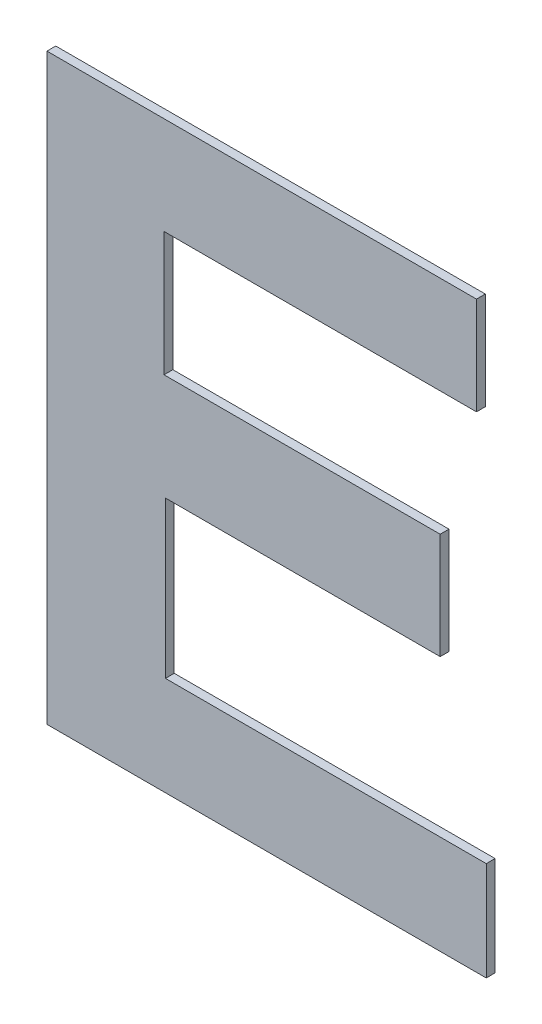
ISO-10303-21;
HEADER;
FILE_DESCRIPTION(('STEP AP214'),'2;1');
FILE_NAME('part.step','',(''),(''),'','','');
FILE_SCHEMA(('AUTOMOTIVE_DESIGN { 1 0 10303 214 1 1 1 1 }'));
ENDSEC;
DATA;
#1=APPLICATION_CONTEXT('core data for automotive mechanical design processes');
#2=APPLICATION_PROTOCOL_DEFINITION('international standard','automotive_design',2000,#1);
#3=PRODUCT_CONTEXT('',#1,'mechanical');
#4=PRODUCT('Part','Part','',(#3));
#5=PRODUCT_RELATED_PRODUCT_CATEGORY('part','',(#4));
#6=PRODUCT_DEFINITION_FORMATION('','',#4);
#7=PRODUCT_DEFINITION_CONTEXT('part definition',#1,'design');
#8=PRODUCT_DEFINITION('design','',#6,#7);
#9=PRODUCT_DEFINITION_SHAPE('','',#8);
#10=(LENGTH_UNIT() NAMED_UNIT(*) SI_UNIT(.MILLI.,.METRE.));
#11=(NAMED_UNIT(*) PLANE_ANGLE_UNIT() SI_UNIT($,.RADIAN.));
#12=(NAMED_UNIT(*) SI_UNIT($,.STERADIAN.) SOLID_ANGLE_UNIT());
#13=UNCERTAINTY_MEASURE_WITH_UNIT(LENGTH_MEASURE(1.E-05),#10,'distance_accuracy_value','');
#14=(GEOMETRIC_REPRESENTATION_CONTEXT(3) GLOBAL_UNCERTAINTY_ASSIGNED_CONTEXT((#13)) GLOBAL_UNIT_ASSIGNED_CONTEXT((#10,
#11,#12)) REPRESENTATION_CONTEXT('',''));
#15=CARTESIAN_POINT('',(0.,0.,0.));
#16=DIRECTION('',(0.,0.,1.));
#17=DIRECTION('',(1.,0.,0.));
#18=AXIS2_PLACEMENT_3D('',#15,#16,#17);
#19=CARTESIAN_POINT('',(3.1948232444765,-0.887060100571832,0.));
#20=DIRECTION('',(0.,1.,0.));
#21=DIRECTION('',(-1.,0.,0.));
#22=AXIS2_PLACEMENT_3D('',#19,#20,#21);
#23=PLANE('',#22);
#24=DIRECTION('',(-1.,0.,0.));
#25=VECTOR('',#24,1.);
#26=CARTESIAN_POINT('',(3.1948232444765,-0.887060100571832,0.));
#27=LINE('',#26,#25);
#28=CARTESIAN_POINT('',(3.1948232444765,-0.887060100571832,0.));
#29=VERTEX_POINT('',#28);
#30=CARTESIAN_POINT('',(3.085668951248,-0.887060100571832,0.));
#31=VERTEX_POINT('',#30);
#32=EDGE_CURVE('E11',#29,#31,#27,.T.);
#33=ORIENTED_EDGE('',*,*,#32,.T.);
#34=DIRECTION('',(0.,0.,1.));
#35=VECTOR('',#34,1.);
#36=CARTESIAN_POINT('',(3.085668951248,-0.887060100571832,0.));
#37=LINE('',#36,#35);
#38=CARTESIAN_POINT('',(3.085668951248,-0.887060100571832,0.003));
#39=VERTEX_POINT('',#38);
#40=EDGE_CURVE('E24',#31,#39,#37,.T.);
#41=ORIENTED_EDGE('',*,*,#40,.T.);
#42=DIRECTION('',(-1.,0.,0.));
#43=VECTOR('',#42,1.);
#44=CARTESIAN_POINT('',(3.1948232444765,-0.887060100571832,0.003));
#45=LINE('',#44,#43);
#46=CARTESIAN_POINT('',(3.1948232444765,-0.887060100571832,0.003));
#47=VERTEX_POINT('',#46);
#48=EDGE_CURVE('E124',#47,#39,#45,.T.);
#49=ORIENTED_EDGE('',*,*,#48,.F.);
#50=DIRECTION('',(0.,0.,1.));
#51=VECTOR('',#50,1.);
#52=CARTESIAN_POINT('',(3.1948232444765,-0.887060100571832,0.));
#53=LINE('',#52,#51);
#54=EDGE_CURVE('E206',#29,#47,#53,.T.);
#55=ORIENTED_EDGE('',*,*,#54,.F.);
#56=EDGE_LOOP('',(#33,#41,#49,#55));
#57=FACE_BOUND('',#56,.T.);
#58=ADVANCED_FACE('F17',(#57),#23,.T.);
#59=CARTESIAN_POINT('',(3.1948232444765,-0.920762187220293,0.));
#60=DIRECTION('',(1.,0.,0.));
#61=DIRECTION('',(0.,1.,0.));
#62=AXIS2_PLACEMENT_3D('',#59,#60,#61);
#63=PLANE('',#62);
#64=DIRECTION('',(0.,1.,0.));
#65=VECTOR('',#64,1.);
#66=CARTESIAN_POINT('',(3.1948232444765,-0.920762187220293,0.));
#67=LINE('',#66,#65);
#68=CARTESIAN_POINT('',(3.1948232444765,-0.920762187220293,0.));
#69=VERTEX_POINT('',#68);
#70=EDGE_CURVE('E203',#69,#29,#67,.T.);
#71=ORIENTED_EDGE('',*,*,#70,.T.);
#72=ORIENTED_EDGE('',*,*,#54,.T.);
#73=DIRECTION('',(0.,1.,0.));
#74=VECTOR('',#73,1.);
#75=CARTESIAN_POINT('',(3.1948232444765,-0.920762187220293,0.003));
#76=LINE('',#75,#74);
#77=CARTESIAN_POINT('',(3.1948232444765,-0.920762187220293,0.003));
#78=VERTEX_POINT('',#77);
#79=EDGE_CURVE('E201',#78,#47,#76,.T.);
#80=ORIENTED_EDGE('',*,*,#79,.F.);
#81=DIRECTION('',(0.,0.,1.));
#82=VECTOR('',#81,1.);
#83=CARTESIAN_POINT('',(3.1948232444765,-0.920762187220293,0.));
#84=LINE('',#83,#82);
#85=EDGE_CURVE('E198',#69,#78,#84,.T.);
#86=ORIENTED_EDGE('',*,*,#85,.F.);
#87=EDGE_LOOP('',(#71,#72,#80,#86));
#88=FACE_BOUND('',#87,.T.);
#89=ADVANCED_FACE('F235',(#88),#63,.T.);
#90=CARTESIAN_POINT('',(3.0453539502456,-0.920762187220293,0.));
#91=DIRECTION('',(0.,-1.,0.));
#92=DIRECTION('',(1.,0.,0.));
#93=AXIS2_PLACEMENT_3D('',#90,#91,#92);
#94=PLANE('',#93);
#95=DIRECTION('',(1.,0.,0.));
#96=VECTOR('',#95,1.);
#97=CARTESIAN_POINT('',(3.0453539502456,-0.920762187220293,0.));
#98=LINE('',#97,#96);
#99=CARTESIAN_POINT('',(3.0453539502456,-0.920762187220293,0.));
#100=VERTEX_POINT('',#99);
#101=EDGE_CURVE('E195',#100,#69,#98,.T.);
#102=ORIENTED_EDGE('',*,*,#101,.T.);
#103=ORIENTED_EDGE('',*,*,#85,.T.);
#104=DIRECTION('',(1.,0.,0.));
#105=VECTOR('',#104,1.);
#106=CARTESIAN_POINT('',(3.0453539502456,-0.920762187220293,0.003));
#107=LINE('',#106,#105);
#108=CARTESIAN_POINT('',(3.0453539502456,-0.920762187220293,0.003));
#109=VERTEX_POINT('',#108);
#110=EDGE_CURVE('E192',#109,#78,#107,.T.);
#111=ORIENTED_EDGE('',*,*,#110,.F.);
#112=DIRECTION('',(0.,0.,1.));
#113=VECTOR('',#112,1.);
#114=CARTESIAN_POINT('',(3.0453539502456,-0.920762187220293,0.));
#115=LINE('',#114,#113);
#116=EDGE_CURVE('E189',#100,#109,#115,.T.);
#117=ORIENTED_EDGE('',*,*,#116,.F.);
#118=EDGE_LOOP('',(#102,#103,#111,#117));
#119=FACE_BOUND('',#118,.T.);
#120=ADVANCED_FACE('F232',(#119),#94,.T.);
#121=CARTESIAN_POINT('',(3.0453539502456,-0.722389912967327,0.));
#122=DIRECTION('',(-1.,0.,0.));
#123=DIRECTION('',(0.,-1.,0.));
#124=AXIS2_PLACEMENT_3D('',#121,#122,#123);
#125=PLANE('',#124);
#126=DIRECTION('',(0.,-1.,0.));
#127=VECTOR('',#126,1.);
#128=CARTESIAN_POINT('',(3.0453539502456,-0.722389912967327,0.));
#129=LINE('',#128,#127);
#130=CARTESIAN_POINT('',(3.0453539502456,-0.722389912967327,0.));
#131=VERTEX_POINT('',#130);
#132=EDGE_CURVE('E186',#131,#100,#129,.T.);
#133=ORIENTED_EDGE('',*,*,#132,.T.);
#134=ORIENTED_EDGE('',*,*,#116,.T.);
#135=DIRECTION('',(0.,-1.,0.));
#136=VECTOR('',#135,1.);
#137=CARTESIAN_POINT('',(3.0453539502456,-0.722389912967327,0.003));
#138=LINE('',#137,#136);
#139=CARTESIAN_POINT('',(3.0453539502456,-0.722389912967327,0.003));
#140=VERTEX_POINT('',#139);
#141=EDGE_CURVE('E183',#140,#109,#138,.T.);
#142=ORIENTED_EDGE('',*,*,#141,.F.);
#143=DIRECTION('',(0.,0.,1.));
#144=VECTOR('',#143,1.);
#145=CARTESIAN_POINT('',(3.0453539502456,-0.722389912967327,0.));
#146=LINE('',#145,#144);
#147=EDGE_CURVE('E180',#131,#140,#146,.T.);
#148=ORIENTED_EDGE('',*,*,#147,.F.);
#149=EDGE_LOOP('',(#133,#134,#142,#148));
#150=FACE_BOUND('',#149,.T.);
#151=ADVANCED_FACE('F229',(#150),#125,.T.);
#152=CARTESIAN_POINT('',(3.1915002100181,-0.722389912967327,0.));
#153=DIRECTION('',(0.,1.,0.));
#154=DIRECTION('',(-1.,0.,0.));
#155=AXIS2_PLACEMENT_3D('',#152,#153,#154);
#156=PLANE('',#155);
#157=DIRECTION('',(-1.,0.,0.));
#158=VECTOR('',#157,1.);
#159=CARTESIAN_POINT('',(3.1915002100181,-0.722389912967327,0.));
#160=LINE('',#159,#158);
#161=CARTESIAN_POINT('',(3.1915002100181,-0.722389912967327,0.));
#162=VERTEX_POINT('',#161);
#163=EDGE_CURVE('E177',#162,#131,#160,.T.);
#164=ORIENTED_EDGE('',*,*,#163,.T.);
#165=ORIENTED_EDGE('',*,*,#147,.T.);
#166=DIRECTION('',(-1.,0.,0.));
#167=VECTOR('',#166,1.);
#168=CARTESIAN_POINT('',(3.1915002100181,-0.722389912967327,0.003));
#169=LINE('',#168,#167);
#170=CARTESIAN_POINT('',(3.1915002100181,-0.722389912967327,0.003));
#171=VERTEX_POINT('',#170);
#172=EDGE_CURVE('E174',#171,#140,#169,.T.);
#173=ORIENTED_EDGE('',*,*,#172,.F.);
#174=DIRECTION('',(0.,0.,1.));
#175=VECTOR('',#174,1.);
#176=CARTESIAN_POINT('',(3.1915002100181,-0.722389912967327,0.));
#177=LINE('',#176,#175);
#178=EDGE_CURVE('E171',#162,#171,#177,.T.);
#179=ORIENTED_EDGE('',*,*,#178,.F.);
#180=EDGE_LOOP('',(#164,#165,#173,#179));
#181=FACE_BOUND('',#180,.T.);
#182=ADVANCED_FACE('F226',(#181),#156,.T.);
#183=CARTESIAN_POINT('',(3.1915002100181,-0.755614573912357,0.));
#184=DIRECTION('',(1.,0.,0.));
#185=DIRECTION('',(0.,1.,0.));
#186=AXIS2_PLACEMENT_3D('',#183,#184,#185);
#187=PLANE('',#186);
#188=DIRECTION('',(0.,1.,0.));
#189=VECTOR('',#188,1.);
#190=CARTESIAN_POINT('',(3.1915002100181,-0.755614573912357,0.));
#191=LINE('',#190,#189);
#192=CARTESIAN_POINT('',(3.1915002100181,-0.755614573912357,0.));
#193=VERTEX_POINT('',#192);
#194=EDGE_CURVE('E168',#193,#162,#191,.T.);
#195=ORIENTED_EDGE('',*,*,#194,.T.);
#196=ORIENTED_EDGE('',*,*,#178,.T.);
#197=DIRECTION('',(0.,1.,0.));
#198=VECTOR('',#197,1.);
#199=CARTESIAN_POINT('',(3.1915002100181,-0.755614573912357,0.003));
#200=LINE('',#199,#198);
#201=CARTESIAN_POINT('',(3.1915002100181,-0.755614573912357,0.003));
#202=VERTEX_POINT('',#201);
#203=EDGE_CURVE('E165',#202,#171,#200,.T.);
#204=ORIENTED_EDGE('',*,*,#203,.F.);
#205=DIRECTION('',(0.,0.,1.));
#206=VECTOR('',#205,1.);
#207=CARTESIAN_POINT('',(3.1915002100181,-0.755614573912357,0.));
#208=LINE('',#207,#206);
#209=EDGE_CURVE('E162',#193,#202,#208,.T.);
#210=ORIENTED_EDGE('',*,*,#209,.F.);
#211=EDGE_LOOP('',(#195,#196,#204,#210));
#212=FACE_BOUND('',#211,.T.);
#213=ADVANCED_FACE('F223',(#212),#187,.T.);
#214=CARTESIAN_POINT('',(3.0851877364518,-0.755614573912357,0.));
#215=DIRECTION('',(0.,-1.,0.));
#216=DIRECTION('',(1.,0.,0.));
#217=AXIS2_PLACEMENT_3D('',#214,#215,#216);
#218=PLANE('',#217);
#219=DIRECTION('',(1.,0.,0.));
#220=VECTOR('',#219,1.);
#221=CARTESIAN_POINT('',(3.0851877364518,-0.755614573912357,0.));
#222=LINE('',#221,#220);
#223=CARTESIAN_POINT('',(3.0851877364518,-0.755614573912357,0.));
#224=VERTEX_POINT('',#223);
#225=EDGE_CURVE('E159',#224,#193,#222,.T.);
#226=ORIENTED_EDGE('',*,*,#225,.T.);
#227=ORIENTED_EDGE('',*,*,#209,.T.);
#228=DIRECTION('',(1.,0.,0.));
#229=VECTOR('',#228,1.);
#230=CARTESIAN_POINT('',(3.0851877364518,-0.755614573912357,0.003));
#231=LINE('',#230,#229);
#232=CARTESIAN_POINT('',(3.0851877364518,-0.755614573912357,0.003));
#233=VERTEX_POINT('',#232);
#234=EDGE_CURVE('E156',#233,#202,#231,.T.);
#235=ORIENTED_EDGE('',*,*,#234,.F.);
#236=DIRECTION('',(0.,0.,1.));
#237=VECTOR('',#236,1.);
#238=CARTESIAN_POINT('',(3.0851877364518,-0.755614573912357,0.));
#239=LINE('',#238,#237);
#240=EDGE_CURVE('E153',#224,#233,#239,.T.);
#241=ORIENTED_EDGE('',*,*,#240,.F.);
#242=EDGE_LOOP('',(#226,#227,#235,#241));
#243=FACE_BOUND('',#242,.T.);
#244=ADVANCED_FACE('F220',(#243),#218,.T.);
#245=CARTESIAN_POINT('',(3.0851877364518,-0.797845908640481,0.));
#246=DIRECTION('',(1.,0.,0.));
#247=DIRECTION('',(0.,1.,0.));
#248=AXIS2_PLACEMENT_3D('',#245,#246,#247);
#249=PLANE('',#248);
#250=DIRECTION('',(0.,1.,0.));
#251=VECTOR('',#250,1.);
#252=CARTESIAN_POINT('',(3.0851877364518,-0.797845908640481,0.));
#253=LINE('',#252,#251);
#254=CARTESIAN_POINT('',(3.0851877364518,-0.797845908640481,0.));
#255=VERTEX_POINT('',#254);
#256=EDGE_CURVE('E150',#255,#224,#253,.T.);
#257=ORIENTED_EDGE('',*,*,#256,.T.);
#258=ORIENTED_EDGE('',*,*,#240,.T.);
#259=DIRECTION('',(0.,1.,0.));
#260=VECTOR('',#259,1.);
#261=CARTESIAN_POINT('',(3.0851877364518,-0.797845908640481,0.003));
#262=LINE('',#261,#260);
#263=CARTESIAN_POINT('',(3.0851877364518,-0.797845908640481,0.003));
#264=VERTEX_POINT('',#263);
#265=EDGE_CURVE('E147',#264,#233,#262,.T.);
#266=ORIENTED_EDGE('',*,*,#265,.F.);
#267=DIRECTION('',(0.,0.,1.));
#268=VECTOR('',#267,1.);
#269=CARTESIAN_POINT('',(3.0851877364518,-0.797845908640481,0.));
#270=LINE('',#269,#268);
#271=EDGE_CURVE('E144',#255,#264,#270,.T.);
#272=ORIENTED_EDGE('',*,*,#271,.F.);
#273=EDGE_LOOP('',(#257,#258,#266,#272));
#274=FACE_BOUND('',#273,.T.);
#275=ADVANCED_FACE('F217',(#274),#249,.T.);
#276=CARTESIAN_POINT('',(3.1791449253996,-0.797845908640481,0.));
#277=DIRECTION('',(0.,1.,0.));
#278=DIRECTION('',(-1.,0.,0.));
#279=AXIS2_PLACEMENT_3D('',#276,#277,#278);
#280=PLANE('',#279);
#281=DIRECTION('',(-1.,0.,0.));
#282=VECTOR('',#281,1.);
#283=CARTESIAN_POINT('',(3.1791449253996,-0.797845908640481,0.));
#284=LINE('',#283,#282);
#285=CARTESIAN_POINT('',(3.1791449253996,-0.797845908640481,0.));
#286=VERTEX_POINT('',#285);
#287=EDGE_CURVE('E141',#286,#255,#284,.T.);
#288=ORIENTED_EDGE('',*,*,#287,.T.);
#289=ORIENTED_EDGE('',*,*,#271,.T.);
#290=DIRECTION('',(-1.,0.,0.));
#291=VECTOR('',#290,1.);
#292=CARTESIAN_POINT('',(3.1791449253996,-0.797845908640481,0.003));
#293=LINE('',#292,#291);
#294=CARTESIAN_POINT('',(3.1791449253996,-0.797845908640481,0.003));
#295=VERTEX_POINT('',#294);
#296=EDGE_CURVE('E138',#295,#264,#293,.T.);
#297=ORIENTED_EDGE('',*,*,#296,.F.);
#298=DIRECTION('',(0.,0.,1.));
#299=VECTOR('',#298,1.);
#300=CARTESIAN_POINT('',(3.1791449253996,-0.797845908640481,0.));
#301=LINE('',#300,#299);
#302=EDGE_CURVE('E135',#286,#295,#301,.T.);
#303=ORIENTED_EDGE('',*,*,#302,.F.);
#304=EDGE_LOOP('',(#288,#289,#297,#303));
#305=FACE_BOUND('',#304,.T.);
#306=ADVANCED_FACE('F214',(#305),#280,.T.);
#307=CARTESIAN_POINT('',(3.1791449253996,-0.833913336521115,0.));
#308=DIRECTION('',(1.,0.,0.));
#309=DIRECTION('',(0.,1.,0.));
#310=AXIS2_PLACEMENT_3D('',#307,#308,#309);
#311=PLANE('',#310);
#312=DIRECTION('',(0.,1.,0.));
#313=VECTOR('',#312,1.);
#314=CARTESIAN_POINT('',(3.1791449253996,-0.833913336521115,0.));
#315=LINE('',#314,#313);
#316=CARTESIAN_POINT('',(3.1791449253996,-0.833913336521115,0.));
#317=VERTEX_POINT('',#316);
#318=EDGE_CURVE('E132',#317,#286,#315,.T.);
#319=ORIENTED_EDGE('',*,*,#318,.T.);
#320=ORIENTED_EDGE('',*,*,#302,.T.);
#321=DIRECTION('',(0.,1.,0.));
#322=VECTOR('',#321,1.);
#323=CARTESIAN_POINT('',(3.1791449253996,-0.833913336521115,0.003));
#324=LINE('',#323,#322);
#325=CARTESIAN_POINT('',(3.1791449253996,-0.833913336521115,0.003));
#326=VERTEX_POINT('',#325);
#327=EDGE_CURVE('E130',#326,#295,#324,.T.);
#328=ORIENTED_EDGE('',*,*,#327,.F.);
#329=DIRECTION('',(0.,0.,1.));
#330=VECTOR('',#329,1.);
#331=CARTESIAN_POINT('',(3.1791449253996,-0.833913336521115,0.));
#332=LINE('',#331,#330);
#333=EDGE_CURVE('E109',#317,#326,#332,.T.);
#334=ORIENTED_EDGE('',*,*,#333,.F.);
#335=EDGE_LOOP('',(#319,#320,#328,#334));
#336=FACE_BOUND('',#335,.T.);
#337=ADVANCED_FACE('F212',(#336),#311,.T.);
#338=CARTESIAN_POINT('',(3.085668951248,-0.833913336521115,0.));
#339=DIRECTION('',(0.,-1.,0.));
#340=DIRECTION('',(1.,0.,0.));
#341=AXIS2_PLACEMENT_3D('',#338,#339,#340);
#342=PLANE('',#341);
#343=DIRECTION('',(1.,0.,0.));
#344=VECTOR('',#343,1.);
#345=CARTESIAN_POINT('',(3.085668951248,-0.833913336521115,0.));
#346=LINE('',#345,#344);
#347=CARTESIAN_POINT('',(3.085668951248,-0.833913336521115,0.));
#348=VERTEX_POINT('',#347);
#349=EDGE_CURVE('E113',#348,#317,#346,.T.);
#350=ORIENTED_EDGE('',*,*,#349,.T.);
#351=ORIENTED_EDGE('',*,*,#333,.T.);
#352=DIRECTION('',(1.,0.,0.));
#353=VECTOR('',#352,1.);
#354=CARTESIAN_POINT('',(3.085668951248,-0.833913336521115,0.003));
#355=LINE('',#354,#353);
#356=CARTESIAN_POINT('',(3.085668951248,-0.833913336521115,0.003));
#357=VERTEX_POINT('',#356);
#358=EDGE_CURVE('E102',#357,#326,#355,.T.);
#359=ORIENTED_EDGE('',*,*,#358,.F.);
#360=DIRECTION('',(0.,0.,1.));
#361=VECTOR('',#360,1.);
#362=CARTESIAN_POINT('',(3.085668951248,-0.833913336521115,0.));
#363=LINE('',#362,#361);
#364=EDGE_CURVE('E106',#348,#357,#363,.T.);
#365=ORIENTED_EDGE('',*,*,#364,.F.);
#366=EDGE_LOOP('',(#350,#351,#359,#365));
#367=FACE_BOUND('',#366,.T.);
#368=ADVANCED_FACE('F105',(#367),#342,.T.);
#369=CARTESIAN_POINT('',(3.085668951248,-0.887060100571832,0.));
#370=DIRECTION('',(1.,0.,0.));
#371=DIRECTION('',(0.,1.,0.));
#372=AXIS2_PLACEMENT_3D('',#369,#370,#371);
#373=PLANE('',#372);
#374=DIRECTION('',(0.,1.,0.));
#375=VECTOR('',#374,1.);
#376=CARTESIAN_POINT('',(3.085668951248,-0.887060100571832,0.));
#377=LINE('',#376,#375);
#378=EDGE_CURVE('E119',#31,#348,#377,.T.);
#379=ORIENTED_EDGE('',*,*,#378,.T.);
#380=ORIENTED_EDGE('',*,*,#364,.T.);
#381=DIRECTION('',(0.,1.,0.));
#382=VECTOR('',#381,1.);
#383=CARTESIAN_POINT('',(3.085668951248,-0.887060100571832,0.003));
#384=LINE('',#383,#382);
#385=EDGE_CURVE('E118',#39,#357,#384,.T.);
#386=ORIENTED_EDGE('',*,*,#385,.F.);
#387=ORIENTED_EDGE('',*,*,#40,.F.);
#388=EDGE_LOOP('',(#379,#380,#386,#387));
#389=FACE_BOUND('',#388,.T.);
#390=ADVANCED_FACE('F117',(#389),#373,.T.);
#391=CARTESIAN_POINT('',(3.120088597361,-0.82157605009381,0.003));
#392=DIRECTION('',(0.,0.,1.));
#393=DIRECTION('',(1.,0.,0.));
#394=AXIS2_PLACEMENT_3D('',#391,#392,#393);
#395=PLANE('',#394);
#396=ORIENTED_EDGE('',*,*,#385,.T.);
#397=ORIENTED_EDGE('',*,*,#358,.T.);
#398=ORIENTED_EDGE('',*,*,#327,.T.);
#399=ORIENTED_EDGE('',*,*,#296,.T.);
#400=ORIENTED_EDGE('',*,*,#265,.T.);
#401=ORIENTED_EDGE('',*,*,#234,.T.);
#402=ORIENTED_EDGE('',*,*,#203,.T.);
#403=ORIENTED_EDGE('',*,*,#172,.T.);
#404=ORIENTED_EDGE('',*,*,#141,.T.);
#405=ORIENTED_EDGE('',*,*,#110,.T.);
#406=ORIENTED_EDGE('',*,*,#79,.T.);
#407=ORIENTED_EDGE('',*,*,#48,.T.);
#408=EDGE_LOOP('',(#396,#397,#398,#399,#400,#401,#402,#403,#404,#405,#406,#407));
#409=FACE_BOUND('',#408,.T.);
#410=ADVANCED_FACE('F122',(#409),#395,.T.);
#411=CARTESIAN_POINT('',(3.120088597361,-0.82157605009381,0.));
#412=DIRECTION('',(0.,0.,1.));
#413=DIRECTION('',(1.,0.,0.));
#414=AXIS2_PLACEMENT_3D('',#411,#412,#413);
#415=PLANE('',#414);
#416=ORIENTED_EDGE('',*,*,#378,.F.);
#417=ORIENTED_EDGE('',*,*,#32,.F.);
#418=ORIENTED_EDGE('',*,*,#70,.F.);
#419=ORIENTED_EDGE('',*,*,#101,.F.);
#420=ORIENTED_EDGE('',*,*,#132,.F.);
#421=ORIENTED_EDGE('',*,*,#163,.F.);
#422=ORIENTED_EDGE('',*,*,#194,.F.);
#423=ORIENTED_EDGE('',*,*,#225,.F.);
#424=ORIENTED_EDGE('',*,*,#256,.F.);
#425=ORIENTED_EDGE('',*,*,#287,.F.);
#426=ORIENTED_EDGE('',*,*,#318,.F.);
#427=ORIENTED_EDGE('',*,*,#349,.F.);
#428=EDGE_LOOP('',(#416,#417,#418,#419,#420,#421,#422,#423,#424,#425,#426,#427));
#429=FACE_BOUND('',#428,.T.);
#430=ADVANCED_FACE('F209',(#429),#415,.F.);
#431=CLOSED_SHELL('',(#58,#89,#120,#151,#182,#213,#244,#275,#306,#337,#368,#390,#410,#430));
#432=MANIFOLD_SOLID_BREP('B1',#431);
#433=ADVANCED_BREP_SHAPE_REPRESENTATION('',(#18,#432),#14);
#434=SHAPE_DEFINITION_REPRESENTATION(#9,#433);
ENDSEC;
END-ISO-10303-21;
